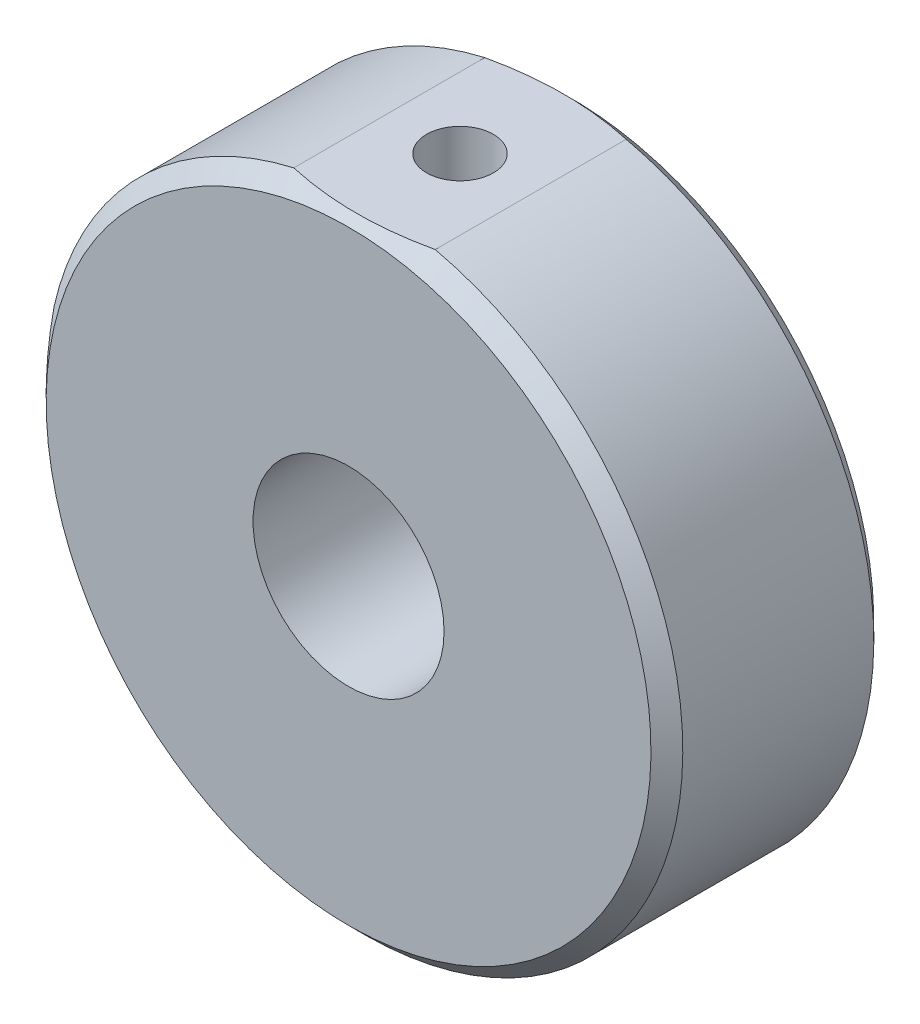
ISO-10303-21;
HEADER;
FILE_DESCRIPTION(('STEP AP214'),'2;1');
FILE_NAME('part.step','',(''),(''),'','','');
FILE_SCHEMA(('AUTOMOTIVE_DESIGN { 1 0 10303 214 1 1 1 1 }'));
ENDSEC;
DATA;
#1=APPLICATION_CONTEXT('core data for automotive mechanical design processes');
#2=APPLICATION_PROTOCOL_DEFINITION('international standard','automotive_design',2000,#1);
#3=PRODUCT_CONTEXT('',#1,'mechanical');
#4=PRODUCT('Part','Part','',(#3));
#5=PRODUCT_RELATED_PRODUCT_CATEGORY('part','',(#4));
#6=PRODUCT_DEFINITION_FORMATION('','',#4);
#7=PRODUCT_DEFINITION_CONTEXT('part definition',#1,'design');
#8=PRODUCT_DEFINITION('design','',#6,#7);
#9=PRODUCT_DEFINITION_SHAPE('','',#8);
#10=(LENGTH_UNIT() NAMED_UNIT(*) SI_UNIT(.MILLI.,.METRE.));
#11=(NAMED_UNIT(*) PLANE_ANGLE_UNIT() SI_UNIT($,.RADIAN.));
#12=(NAMED_UNIT(*) SI_UNIT($,.STERADIAN.) SOLID_ANGLE_UNIT());
#13=UNCERTAINTY_MEASURE_WITH_UNIT(LENGTH_MEASURE(1.E-05),#10,'distance_accuracy_value','');
#14=(GEOMETRIC_REPRESENTATION_CONTEXT(3) GLOBAL_UNCERTAINTY_ASSIGNED_CONTEXT((#13)) GLOBAL_UNIT_ASSIGNED_CONTEXT((#10,
#11,#12)) REPRESENTATION_CONTEXT('',''));
#15=CARTESIAN_POINT('',(0.,0.,0.));
#16=DIRECTION('',(0.,0.,1.));
#17=DIRECTION('',(1.,0.,0.));
#18=AXIS2_PLACEMENT_3D('',#15,#16,#17);
#19=CARTESIAN_POINT('',(0.,0.,14.));
#20=DIRECTION('',(0.,0.,1.));
#21=DIRECTION('',(1.,0.,0.));
#22=AXIS2_PLACEMENT_3D('',#19,#20,#21);
#23=PLANE('',#22);
#24=CARTESIAN_POINT('',(0.,0.,14.));
#25=DIRECTION('',(0.,0.,1.));
#26=DIRECTION('',(1.,0.,0.));
#27=AXIS2_PLACEMENT_3D('',#24,#25,#26);
#28=CIRCLE('',#27,19.);
#29=CARTESIAN_POINT('',(-4.2218923482249,18.525,14.));
#30=VERTEX_POINT('',#29);
#31=EDGE_CURVE('E52',#30,#30,#28,.T.);
#32=ORIENTED_EDGE('',*,*,#31,.T.);
#33=EDGE_LOOP('',(#32));
#34=FACE_BOUND('',#33,.T.);
#35=CARTESIAN_POINT('',(0.,0.,14.));
#36=DIRECTION('',(0.,0.,1.));
#37=DIRECTION('',(1.,0.,0.));
#38=AXIS2_PLACEMENT_3D('',#35,#36,#37);
#39=CIRCLE('',#38,6.);
#40=CARTESIAN_POINT('',(6.,0.,14.));
#41=VERTEX_POINT('',#40);
#42=EDGE_CURVE('E166',#41,#41,#39,.T.);
#43=ORIENTED_EDGE('',*,*,#42,.F.);
#44=EDGE_LOOP('',(#43));
#45=FACE_BOUND('',#44,.T.);
#46=ADVANCED_FACE('F35',(#34,#45),#23,.T.);
#47=CARTESIAN_POINT('',(0.,0.,0.));
#48=DIRECTION('',(0.,0.,1.));
#49=DIRECTION('',(1.,0.,0.));
#50=AXIS2_PLACEMENT_3D('',#47,#48,#49);
#51=PLANE('',#50);
#52=CARTESIAN_POINT('',(0.,0.,0.));
#53=DIRECTION('',(0.,0.,1.));
#54=DIRECTION('',(1.,0.,0.));
#55=AXIS2_PLACEMENT_3D('',#52,#53,#54);
#56=CIRCLE('',#55,19.);
#57=CARTESIAN_POINT('',(-4.2218923482249,18.525,0.));
#58=VERTEX_POINT('',#57);
#59=EDGE_CURVE('E11',#58,#58,#56,.F.);
#60=ORIENTED_EDGE('',*,*,#59,.T.);
#61=EDGE_LOOP('',(#60));
#62=FACE_BOUND('',#61,.T.);
#63=CARTESIAN_POINT('',(0.,0.,0.));
#64=DIRECTION('',(0.,0.,1.));
#65=DIRECTION('',(1.,0.,0.));
#66=AXIS2_PLACEMENT_3D('',#63,#64,#65);
#67=CIRCLE('',#66,6.);
#68=CARTESIAN_POINT('',(6.,0.,0.));
#69=VERTEX_POINT('',#68);
#70=EDGE_CURVE('E164',#69,#69,#67,.T.);
#71=ORIENTED_EDGE('',*,*,#70,.T.);
#72=EDGE_LOOP('',(#71));
#73=FACE_BOUND('',#72,.T.);
#74=ADVANCED_FACE('F126',(#62,#73),#51,.F.);
#75=CARTESIAN_POINT('',(0.,0.,14.));
#76=DIRECTION('',(0.,0.,-1.));
#77=DIRECTION('',(-1.,0.,0.));
#78=AXIS2_PLACEMENT_3D('',#75,#76,#77);
#79=CYLINDRICAL_SURFACE('',#78,20.);
#80=DIRECTION('',(0.,0.,-1.));
#81=VECTOR('',#80,1.);
#82=CARTESIAN_POINT('',(4.44409720865779,19.5,14.));
#83=LINE('',#82,#81);
#84=CARTESIAN_POINT('',(4.44409720865779,19.5,13.));
#85=VERTEX_POINT('',#84);
#86=CARTESIAN_POINT('',(4.44409720865779,19.5,0.999999999999999));
#87=VERTEX_POINT('',#86);
#88=EDGE_CURVE('E173',#85,#87,#83,.T.);
#89=ORIENTED_EDGE('',*,*,#88,.F.);
#90=CARTESIAN_POINT('',(0.,0.,13.));
#91=DIRECTION('',(0.,0.,-1.));
#92=DIRECTION('',(-1.,0.,0.));
#93=AXIS2_PLACEMENT_3D('',#90,#91,#92);
#94=CIRCLE('',#93,20.);
#95=CARTESIAN_POINT('',(-19.5,-4.44409720865783,13.));
#96=VERTEX_POINT('',#95);
#97=EDGE_CURVE('E187',#85,#96,#94,.T.);
#98=ORIENTED_EDGE('',*,*,#97,.T.);
#99=DIRECTION('',(0.,0.,-1.));
#100=VECTOR('',#99,1.);
#101=CARTESIAN_POINT('',(-19.5,-4.44409720865783,14.));
#102=LINE('',#101,#100);
#103=CARTESIAN_POINT('',(-19.5,-4.44409720865783,1.));
#104=VERTEX_POINT('',#103);
#105=EDGE_CURVE('E84',#96,#104,#102,.T.);
#106=ORIENTED_EDGE('',*,*,#105,.T.);
#107=CARTESIAN_POINT('',(0.,0.,1.));
#108=DIRECTION('',(0.,0.,1.));
#109=DIRECTION('',(1.,0.,0.));
#110=AXIS2_PLACEMENT_3D('',#107,#108,#109);
#111=CIRCLE('',#110,20.);
#112=EDGE_CURVE('E186',#104,#87,#111,.T.);
#113=ORIENTED_EDGE('',*,*,#112,.T.);
#114=EDGE_LOOP('',(#89,#98,#106,#113));
#115=FACE_BOUND('',#114,.T.);
#116=ADVANCED_FACE('F121',(#115),#79,.T.);
#117=CARTESIAN_POINT('',(-4.44409720865779,19.5,14.));
#118=DIRECTION('',(0.,-1.,0.));
#119=DIRECTION('',(0.,0.,-1.));
#120=AXIS2_PLACEMENT_3D('',#117,#118,#119);
#121=PLANE('',#120);
#122=CARTESIAN_POINT('',(0.,19.5,7.));
#123=DIRECTION('',(0.,1.,0.));
#124=DIRECTION('',(0.,0.,1.));
#125=AXIS2_PLACEMENT_3D('',#122,#123,#124);
#126=CIRCLE('',#125,2.09999999999999);
#127=CARTESIAN_POINT('',(0.,19.5,9.09999999999999));
#128=VERTEX_POINT('',#127);
#129=EDGE_CURVE('E165',#128,#128,#126,.T.);
#130=ORIENTED_EDGE('',*,*,#129,.F.);
#131=EDGE_LOOP('',(#130));
#132=FACE_BOUND('',#131,.T.);
#133=DIRECTION('',(0.,0.,-1.));
#134=VECTOR('',#133,1.);
#135=CARTESIAN_POINT('',(-4.44409720865779,19.5,14.));
#136=LINE('',#135,#134);
#137=CARTESIAN_POINT('',(-4.44409720865779,19.5,13.));
#138=VERTEX_POINT('',#137);
#139=CARTESIAN_POINT('',(-4.44409720865779,19.5,1.00000000000001));
#140=VERTEX_POINT('',#139);
#141=EDGE_CURVE('E98',#138,#140,#136,.T.);
#142=ORIENTED_EDGE('',*,*,#141,.F.);
#143=CARTESIAN_POINT('',(-4.44409720865779,19.5,13.));
#144=CARTESIAN_POINT('',(-4.19998041472766,19.5,13.0542534426218));
#145=CARTESIAN_POINT('',(-3.95494907397,19.5,13.1044426126926));
#146=CARTESIAN_POINT('',(-3.46327045746739,19.5,13.1963133008438));
#147=CARTESIAN_POINT('',(-3.21662300545133,19.5,13.2379938743854));
#148=CARTESIAN_POINT('',(-2.72187842229033,19.5,13.3124712843307));
#149=CARTESIAN_POINT('',(-2.47378073936363,19.5,13.3452644794387));
#150=CARTESIAN_POINT('',(-1.97656220348127,19.5,13.401639434868));
#151=CARTESIAN_POINT('',(-1.72744138944716,19.5,13.4252215423733));
#152=CARTESIAN_POINT('',(-0.989582138907035,19.5,13.4809696706977));
#153=CARTESIAN_POINT('',(-0.499752548169044,19.5,13.4997426988401));
#154=CARTESIAN_POINT('',(0.479706710049869,19.5,13.5002521481147));
#155=CARTESIAN_POINT('',(0.969336390650333,19.5,13.4820006406622));
#156=CARTESIAN_POINT('',(2.01715462635274,19.5,13.4038824216482));
#157=CARTESIAN_POINT('',(2.57492397302026,19.5,13.3383329128359));
#158=CARTESIAN_POINT('',(3.68373467146969,19.5,13.1626695390764));
#159=CARTESIAN_POINT('',(4.23477044033588,19.5,13.0525209787831));
#160=CARTESIAN_POINT('',(5.34099358027311,19.5,12.789104135404));
#161=CARTESIAN_POINT('',(5.89593474985478,19.5,12.6348177665614));
#162=CARTESIAN_POINT('',(6.99355346764258,19.5,12.2903857295308));
#163=CARTESIAN_POINT('',(7.53625100046284,19.5,12.1003040742772));
#164=CARTESIAN_POINT('',(8.07274418775188,19.5,11.895043266548));
#165=B_SPLINE_CURVE_WITH_KNOTS('',3,(#143,#144,#145,#146,#147,#148,#149,#150,#151,#152,#153,
#154,#155,#156,#157,#158,#159,#160,#161,#162,#163,#164),.UNSPECIFIED.,.F.,.F.,(4,2,2,2,2,2,2,2,
2,2,4),(0.,0.750199479304313,1.50048219296257,2.25107184585193,3.00163320481129,
4.47069012827003,5.93926815993727,7.62209777872449,9.30623905948282,11.0328842517489,
12.75647050224),.UNSPECIFIED.);
#166=EDGE_CURVE('E101',#138,#85,#165,.T.);
#167=ORIENTED_EDGE('',*,*,#166,.T.);
#168=ORIENTED_EDGE('',*,*,#88,.T.);
#169=CARTESIAN_POINT('',(4.44409720865779,19.5,0.999999999999998));
#170=CARTESIAN_POINT('',(4.19998041472766,19.5,0.945746557378239));
#171=CARTESIAN_POINT('',(3.95494907397,19.5,0.89555738730737));
#172=CARTESIAN_POINT('',(3.46327045746739,19.5,0.803686699156215));
#173=CARTESIAN_POINT('',(3.21662300545134,19.5,0.762006125614582));
#174=CARTESIAN_POINT('',(2.72187842229033,19.5,0.687528715669268));
#175=CARTESIAN_POINT('',(2.47378073936363,19.5,0.654735520561267));
#176=CARTESIAN_POINT('',(1.97656220348127,19.5,0.598360565132));
#177=CARTESIAN_POINT('',(1.72744138944716,19.5,0.574778457626738));
#178=CARTESIAN_POINT('',(0.989582138907035,19.5,0.519030329302326));
#179=CARTESIAN_POINT('',(0.499752548169045,19.5,0.500257301159913));
#180=CARTESIAN_POINT('',(-0.47970671004987,19.5,0.499747851885359));
#181=CARTESIAN_POINT('',(-0.969336390650334,19.5,0.517999359337806));
#182=CARTESIAN_POINT('',(-2.01715462635274,19.5,0.596117578351778));
#183=CARTESIAN_POINT('',(-2.57492397302026,19.5,0.661667087164062));
#184=CARTESIAN_POINT('',(-3.68373467146968,19.5,0.837330460923594));
#185=CARTESIAN_POINT('',(-4.23477044033587,19.5,0.947479021216934));
#186=CARTESIAN_POINT('',(-5.34099358027309,19.5,1.21089586459604));
#187=CARTESIAN_POINT('',(-5.89593474985476,19.5,1.36518223343856));
#188=CARTESIAN_POINT('',(-6.99355346764256,19.5,1.70961427046916));
#189=CARTESIAN_POINT('',(-7.53625100046281,19.5,1.89969592572283));
#190=CARTESIAN_POINT('',(-8.07274418775185,19.5,2.10495673345201));
#191=B_SPLINE_CURVE_WITH_KNOTS('',3,(#169,#170,#171,#172,#173,#174,#175,#176,#177,#178,#179,
#180,#181,#182,#183,#184,#185,#186,#187,#188,#189,#190),.UNSPECIFIED.,.F.,.F.,(4,2,2,2,2,2,2,2,
2,2,4),(0.,0.750199479304313,1.50048219296257,2.25107184585193,3.00163320481129,
4.47069012827003,5.93926815993728,7.62209777872448,9.30623905948281,11.0328842517489,
12.75647050224),.UNSPECIFIED.);
#192=EDGE_CURVE('E102',#87,#140,#191,.T.);
#193=ORIENTED_EDGE('',*,*,#192,.T.);
#194=EDGE_LOOP('',(#142,#167,#168,#193));
#195=FACE_BOUND('',#194,.T.);
#196=ADVANCED_FACE('F116',(#132,#195),#121,.F.);
#197=CARTESIAN_POINT('',(0.,0.,14.));
#198=DIRECTION('',(0.,0.,-1.));
#199=DIRECTION('',(-1.,0.,0.));
#200=AXIS2_PLACEMENT_3D('',#197,#198,#199);
#201=CYLINDRICAL_SURFACE('',#200,20.);
#202=DIRECTION('',(0.,0.,-1.));
#203=VECTOR('',#202,1.);
#204=CARTESIAN_POINT('',(-19.5,4.44409720865783,14.));
#205=LINE('',#204,#203);
#206=CARTESIAN_POINT('',(-19.5,4.44409720865783,13.));
#207=VERTEX_POINT('',#206);
#208=CARTESIAN_POINT('',(-19.5,4.44409720865783,1.00000000000001));
#209=VERTEX_POINT('',#208);
#210=EDGE_CURVE('E82',#207,#209,#205,.T.);
#211=ORIENTED_EDGE('',*,*,#210,.F.);
#212=CARTESIAN_POINT('',(0.,0.,13.));
#213=DIRECTION('',(0.,0.,1.));
#214=DIRECTION('',(1.,0.,0.));
#215=AXIS2_PLACEMENT_3D('',#212,#213,#214);
#216=CIRCLE('',#215,20.);
#217=EDGE_CURVE('E94',#207,#138,#216,.F.);
#218=ORIENTED_EDGE('',*,*,#217,.T.);
#219=ORIENTED_EDGE('',*,*,#141,.T.);
#220=CARTESIAN_POINT('',(0.,0.,1.));
#221=DIRECTION('',(0.,0.,1.));
#222=DIRECTION('',(1.,0.,0.));
#223=AXIS2_PLACEMENT_3D('',#220,#221,#222);
#224=CIRCLE('',#223,20.);
#225=EDGE_CURVE('E97',#140,#209,#224,.T.);
#226=ORIENTED_EDGE('',*,*,#225,.T.);
#227=EDGE_LOOP('',(#211,#218,#219,#226));
#228=FACE_BOUND('',#227,.T.);
#229=ADVANCED_FACE('F92',(#228),#201,.T.);
#230=CARTESIAN_POINT('',(-19.5,-4.44409720865783,14.));
#231=DIRECTION('',(1.,0.,0.));
#232=DIRECTION('',(0.,0.,-1.));
#233=AXIS2_PLACEMENT_3D('',#230,#231,#232);
#234=PLANE('',#233);
#235=ORIENTED_EDGE('',*,*,#105,.F.);
#236=CARTESIAN_POINT('',(-19.5,-4.44409720865783,13.));
#237=CARTESIAN_POINT('',(-19.5,-4.1999804147277,13.0542534426218));
#238=CARTESIAN_POINT('',(-19.5,-3.95494907397004,13.1044426126926));
#239=CARTESIAN_POINT('',(-19.5,-3.46327045746742,13.1963133008438));
#240=CARTESIAN_POINT('',(-19.5,-3.21662300545137,13.2379938743854));
#241=CARTESIAN_POINT('',(-19.5,-2.72187842229037,13.3124712843307));
#242=CARTESIAN_POINT('',(-19.5,-2.47378073936367,13.3452644794387));
#243=CARTESIAN_POINT('',(-19.5,-1.97656220348131,13.401639434868));
#244=CARTESIAN_POINT('',(-19.5,-1.7274413894472,13.4252215423733));
#245=CARTESIAN_POINT('',(-19.5,-0.989582138907072,13.4809696706977));
#246=CARTESIAN_POINT('',(-19.5,-0.499752548169082,13.4997426988401));
#247=CARTESIAN_POINT('',(-19.5,0.479706710049832,13.5002521481146));
#248=CARTESIAN_POINT('',(-19.5,0.969336390650297,13.4820006406622));
#249=CARTESIAN_POINT('',(-19.5,2.0171546263527,13.4038824216482));
#250=CARTESIAN_POINT('',(-19.5,2.57492397302023,13.3383329128359));
#251=CARTESIAN_POINT('',(-19.5,3.68373467146966,13.1626695390764));
#252=CARTESIAN_POINT('',(-19.5,4.23477044033585,13.0525209787831));
#253=CARTESIAN_POINT('',(-19.5,5.34099358027307,12.789104135404));
#254=CARTESIAN_POINT('',(-19.5,5.89593474985474,12.6348177665615));
#255=CARTESIAN_POINT('',(-19.5,6.99355346764254,12.2903857295309));
#256=CARTESIAN_POINT('',(-19.5,7.5362510004628,12.1003040742772));
#257=CARTESIAN_POINT('',(-19.5,8.07274418775184,11.895043266548));
#258=B_SPLINE_CURVE_WITH_KNOTS('',3,(#236,#237,#238,#239,#240,#241,#242,#243,#244,#245,#246,
#247,#248,#249,#250,#251,#252,#253,#254,#255,#256,#257),.UNSPECIFIED.,.F.,.F.,(4,2,2,2,2,2,2,2,
2,2,4),(0.,0.750199479304313,1.50048219296258,2.25107184585193,3.00163320481129,
4.47069012827003,5.93926815993728,7.62209777872449,9.30623905948282,11.0328842517489,
12.75647050224),.UNSPECIFIED.);
#259=EDGE_CURVE('E44',#96,#207,#258,.T.);
#260=ORIENTED_EDGE('',*,*,#259,.T.);
#261=ORIENTED_EDGE('',*,*,#210,.T.);
#262=CARTESIAN_POINT('',(-19.5,4.44409720865783,1.00000000000001));
#263=CARTESIAN_POINT('',(-19.5,4.1999804147277,0.945746557378249));
#264=CARTESIAN_POINT('',(-19.5,3.95494907397004,0.895557387307378));
#265=CARTESIAN_POINT('',(-19.5,3.46327045746742,0.803686699156221));
#266=CARTESIAN_POINT('',(-19.5,3.21662300545137,0.762006125614588));
#267=CARTESIAN_POINT('',(-19.5,2.72187842229037,0.687528715669276));
#268=CARTESIAN_POINT('',(-19.5,2.47378073936367,0.654735520561277));
#269=CARTESIAN_POINT('',(-19.5,1.97656220348131,0.59836056513201));
#270=CARTESIAN_POINT('',(-19.5,1.7274413894472,0.574778457626746));
#271=CARTESIAN_POINT('',(-19.5,0.989582138907069,0.51903032930233));
#272=CARTESIAN_POINT('',(-19.5,0.499752548169078,0.500257301159914));
#273=CARTESIAN_POINT('',(-19.5,-0.479706710049836,0.499747851885358));
#274=CARTESIAN_POINT('',(-19.5,-0.9693363906503,0.517999359337805));
#275=CARTESIAN_POINT('',(-19.5,-2.0171546263527,0.596117578351779));
#276=CARTESIAN_POINT('',(-19.5,-2.57492397302023,0.661667087164062));
#277=CARTESIAN_POINT('',(-19.5,-3.68373467146965,0.837330460923594));
#278=CARTESIAN_POINT('',(-19.5,-4.23477044033584,0.947479021216932));
#279=CARTESIAN_POINT('',(-19.5,-5.34099358027307,1.21089586459603));
#280=CARTESIAN_POINT('',(-19.5,-5.89593474985473,1.36518223343855));
#281=CARTESIAN_POINT('',(-19.5,-6.99355346764254,1.70961427046916));
#282=CARTESIAN_POINT('',(-19.5,-7.53625100046279,1.89969592572283));
#283=CARTESIAN_POINT('',(-19.5,-8.07274418775183,2.10495673345201));
#284=B_SPLINE_CURVE_WITH_KNOTS('',3,(#262,#263,#264,#265,#266,#267,#268,#269,#270,#271,#272,
#273,#274,#275,#276,#277,#278,#279,#280,#281,#282,#283),.UNSPECIFIED.,.F.,.F.,(4,2,2,2,2,2,2,2,
2,2,4),(0.,0.750199479304314,1.50048219296258,2.25107184585194,3.00163320481129,
4.47069012827003,5.93926815993728,7.62209777872449,9.30623905948282,11.0328842517489,
12.75647050224),.UNSPECIFIED.);
#285=EDGE_CURVE('E88',#209,#104,#284,.T.);
#286=ORIENTED_EDGE('',*,*,#285,.T.);
#287=EDGE_LOOP('',(#235,#260,#261,#286));
#288=FACE_BOUND('',#287,.T.);
#289=ADVANCED_FACE('F81',(#288),#234,.F.);
#290=CARTESIAN_POINT('',(0.,0.,14.));
#291=DIRECTION('',(0.,0.,-1.));
#292=DIRECTION('',(-1.,0.,0.));
#293=AXIS2_PLACEMENT_3D('',#290,#291,#292);
#294=CYLINDRICAL_SURFACE('',#293,6.);
#295=CARTESIAN_POINT('',(0.,6.,9.09999999999999));
#296=CARTESIAN_POINT('',(-0.114251619400622,6.00000124479722,9.10000177398963));
#297=CARTESIAN_POINT('',(-0.228490572963443,5.99670718672287,9.09064619715678));
#298=CARTESIAN_POINT('',(-0.453584015501343,5.98389272550116,9.05359972410268));
#299=CARTESIAN_POINT('',(-0.564438489369617,5.97437229456631,9.0259087460529));
#300=CARTESIAN_POINT('',(-0.779485413609652,5.95013476153419,8.95327063689881));
#301=CARTESIAN_POINT('',(-0.883689296254849,5.93542687718391,8.90835410213658));
#302=CARTESIAN_POINT('',(-1.0830819871769,5.9023013983887,8.80268493324158));
#303=CARTESIAN_POINT('',(-1.17826873947788,5.88388296088765,8.74192869932603));
#304=CARTESIAN_POINT('',(-1.36051553523195,5.8444837041619,8.60390289060956));
#305=CARTESIAN_POINT('',(-1.44718917885624,5.82343705066232,8.52614204906653));
#306=CARTESIAN_POINT('',(-1.60656711090756,5.78150036966384,8.35735799863156));
#307=CARTESIAN_POINT('',(-1.67926788523806,5.76061038283182,8.26633146358774));
#308=CARTESIAN_POINT('',(-1.8109377386165,5.72061212527967,8.07000721026479));
#309=CARTESIAN_POINT('',(-1.86938779836972,5.70158313672156,7.96434366492447));
#310=CARTESIAN_POINT('',(-1.96751959370707,5.66847146607346,7.74391324582527));
#311=CARTESIAN_POINT('',(-2.0072077327117,5.65438709681398,7.62914949359435));
#312=CARTESIAN_POINT('',(-2.06520983596549,5.63345661812697,7.398194180391));
#313=CARTESIAN_POINT('',(-2.08425340292729,5.62636429642411,7.28220886171828));
#314=CARTESIAN_POINT('',(-2.10270718664323,5.61949543126127,7.0484889286481));
#315=CARTESIAN_POINT('',(-2.10212422592437,5.61971634559107,6.93075493634555));
#316=CARTESIAN_POINT('',(-2.08190459940415,5.6272345610432,6.70327032467044));
#317=CARTESIAN_POINT('',(-2.0632422906149,5.63416998262608,6.59341901183151));
#318=CARTESIAN_POINT('',(-2.008991449874,5.65374002730544,6.37851855622538));
#319=CARTESIAN_POINT('',(-1.97340069468363,5.66637539897383,6.27347004620447));
#320=CARTESIAN_POINT('',(-1.88570622655402,5.69616366426815,6.06903257993277));
#321=CARTESIAN_POINT('',(-1.83332799267826,5.71339079553398,5.96977266919094));
#322=CARTESIAN_POINT('',(-1.71373613101811,5.75039287731401,5.78115283060908));
#323=CARTESIAN_POINT('',(-1.64651787673616,5.77016862157703,5.69179600321364));
#324=CARTESIAN_POINT('',(-1.49456039711175,5.81143944787469,5.52007406297834));
#325=CARTESIAN_POINT('',(-1.40903164705239,5.83296775946525,5.43841405027078));
#326=CARTESIAN_POINT('',(-1.22523410835335,5.87432244482545,5.29040207686655));
#327=CARTESIAN_POINT('',(-1.12696383630198,5.8941486199791,5.22405190109764));
#328=CARTESIAN_POINT('',(-0.918860837471083,5.93017388019725,5.10789640524754));
#329=CARTESIAN_POINT('',(-0.808904282046237,5.94632692796734,5.05829766253292));
#330=CARTESIAN_POINT('',(-0.581505085784566,5.9728492941218,4.97852661588011));
#331=CARTESIAN_POINT('',(-0.464065343302138,5.98322083678151,4.94834684033705));
#332=CARTESIAN_POINT('',(-0.230989226208848,5.99663436097715,4.90956051194694));
#333=CARTESIAN_POINT('',(-0.1155295791762,5.99999933499256,4.90000251608865));
#334=CARTESIAN_POINT('',(0.115377891863059,6.00000066417894,4.89999748639476));
#335=CARTESIAN_POINT('',(0.23082571398975,5.99663828885113,4.90954684685785));
#336=CARTESIAN_POINT('',(0.454507376828142,5.98377619392239,4.9467432099422));
#337=CARTESIAN_POINT('',(0.562853716439328,5.97447978494587,4.97379108264015));
#338=CARTESIAN_POINT('',(0.773415026506116,5.95088754065552,5.04445228894033));
#339=CARTESIAN_POINT('',(0.875629201619191,5.93659105846679,5.08806776600755));
#340=CARTESIAN_POINT('',(1.0741840767636,5.90394255172608,5.19195405317889));
#341=CARTESIAN_POINT('',(1.17028394476469,5.88548924058916,5.25265239082213));
#342=CARTESIAN_POINT('',(1.35123467255018,5.84660110480211,5.38848710774389));
#343=CARTESIAN_POINT('',(1.43608178143558,5.82616562334246,5.46362828093436));
#344=CARTESIAN_POINT('',(1.59657189228235,5.78430503834525,5.63068012096844));
#345=CARTESIAN_POINT('',(1.67153670697073,5.76288189348748,5.7232444647861));
#346=CARTESIAN_POINT('',(1.80497245575436,5.72249507214417,5.92008753963991));
#347=CARTESIAN_POINT('',(1.86344281114401,5.70353148196433,6.02436668150853));
#348=CARTESIAN_POINT('',(1.96206588887548,5.67036332969683,6.2420003741245));
#349=CARTESIAN_POINT('',(2.00221823839335,5.65615886447257,6.35535510953101));
#350=CARTESIAN_POINT('',(2.0626509971247,5.63440525238851,6.58783927233181));
#351=CARTESIAN_POINT('',(2.08294160282034,5.62685269082108,6.70696570369192));
#352=CARTESIAN_POINT('',(2.10223163577423,5.61967236621944,6.94037219292531));
#353=CARTESIAN_POINT('',(2.10236838468444,5.61962128080686,7.05454617801122));
#354=CARTESIAN_POINT('',(2.08419060013712,5.62638796100477,7.28119757389456));
#355=CARTESIAN_POINT('',(2.06587739236711,5.63320523310212,7.39367510599812));
#356=CARTESIAN_POINT('',(2.01215791883085,5.65261016405341,7.6111305752457));
#357=CARTESIAN_POINT('',(1.97715663433252,5.66506076725229,7.71622178000828));
#358=CARTESIAN_POINT('',(1.89139271747184,5.69426693797299,7.91911485688415));
#359=CARTESIAN_POINT('',(1.84062637606361,5.71102351840213,8.01691500690893));
#360=CARTESIAN_POINT('',(1.72198212419163,5.74793925414686,8.20746074523538));
#361=CARTESIAN_POINT('',(1.65340944434222,5.76822170996008,8.29974964012088));
#362=CARTESIAN_POINT('',(1.50223440680438,5.80942536879987,8.47187657721011));
#363=CARTESIAN_POINT('',(1.41962789186428,5.83034675958784,8.55171091651121));
#364=CARTESIAN_POINT('',(1.23831189902208,5.87159201716309,8.70027026902842));
#365=CARTESIAN_POINT('',(1.13904838717693,5.89184757341827,8.76834067030566));
#366=CARTESIAN_POINT('',(0.929800577449991,5.92846815702942,8.88677409716774));
#367=CARTESIAN_POINT('',(0.819817701917963,5.94483369956207,8.93713946795423));
#368=CARTESIAN_POINT('',(0.593417902635956,5.97165768609899,9.0179543314247));
#369=CARTESIAN_POINT('',(0.477083727751899,5.98217829048397,9.04861396514205));
#370=CARTESIAN_POINT('',(0.240494094963199,5.99634758229624,9.08963229100308));
#371=CARTESIAN_POINT('',(0.120240033294065,5.99999868995766,9.099998133028));
#372=CARTESIAN_POINT('',(0.,6.,9.09999999999999));
#373=B_SPLINE_CURVE_WITH_KNOTS('',3,(#295,#296,#297,#298,#299,#300,#301,#302,#303,#304,#305,
#306,#307,#308,#309,#310,#311,#312,#313,#314,#315,#316,#317,#318,#319,#320,#321,#322,#323,#324,
#325,#326,#327,#328,#329,#330,#331,#332,#333,#334,#335,#336,#337,#338,#339,#340,#341,#342,#343,
#344,#345,#346,#347,#348,#349,#350,#351,#352,#353,#354,#355,#356,#357,#358,#359,#360,#361,#362,
#363,#364,#365,#366,#367,#368,#369,#370,#371,#372),.UNSPECIFIED.,.T.,.F.,(4,2,2,2,2,2,2,2,2,2,2,
2,2,2,2,2,2,2,2,2,2,2,2,2,2,2,2,2,2,2,2,2,2,2,2,2,2,2,4),(0.,0.34231196641885,0.684625460541924,
1.0263337265292,1.36811971807276,1.72152774061768,2.07502452728511,2.4399323068826,
2.80471545382671,3.15613820349783,3.50743879368811,3.84080280321038,4.1742106060309,
4.51337542799156,4.85264613704542,5.21157468826311,5.57054506475925,5.93379308543941,
6.29690125979618,6.64286253258118,6.98875852603915,7.32339682261908,7.65807842841232,
8.00202226625163,8.34608046478826,8.70745545379959,9.06884312002094,9.43023814118969,
9.79144753447258,10.1322648947516,10.4730577679758,10.8059714961507,11.1389636083741,
11.4876784253318,11.8364967229958,12.2008786824211,12.5652123577469,12.925593343809,
13.2858473380638),.UNSPECIFIED.);
#374=CARTESIAN_POINT('',(0.,6.,9.09999999999999));
#375=VERTEX_POINT('',#374);
#376=EDGE_CURVE('E158',#375,#375,#373,.T.);
#377=ORIENTED_EDGE('',*,*,#376,.F.);
#378=EDGE_LOOP('',(#377));
#379=FACE_BOUND('',#378,.T.);
#380=ORIENTED_EDGE('',*,*,#42,.T.);
#381=EDGE_LOOP('',(#380));
#382=FACE_BOUND('',#381,.T.);
#383=ORIENTED_EDGE('',*,*,#70,.F.);
#384=EDGE_LOOP('',(#383));
#385=FACE_BOUND('',#384,.T.);
#386=ADVANCED_FACE('F143',(#379,#382,#385),#294,.F.);
#387=CARTESIAN_POINT('',(0.,19.5,7.));
#388=DIRECTION('',(0.,1.,0.));
#389=DIRECTION('',(0.,0.,1.));
#390=AXIS2_PLACEMENT_3D('',#387,#388,#389);
#391=CYLINDRICAL_SURFACE('',#390,2.09999999999999);
#392=ORIENTED_EDGE('',*,*,#129,.T.);
#393=EDGE_LOOP('',(#392));
#394=FACE_BOUND('',#393,.T.);
#395=ORIENTED_EDGE('',*,*,#376,.T.);
#396=EDGE_LOOP('',(#395));
#397=FACE_BOUND('',#396,.T.);
#398=ADVANCED_FACE('F130',(#394,#397),#391,.F.);
#399=CARTESIAN_POINT('',(0.,0.,14.));
#400=DIRECTION('',(0.,0.,-1.));
#401=DIRECTION('',(-1.,0.,0.));
#402=AXIS2_PLACEMENT_3D('',#399,#400,#401);
#403=CONICAL_SURFACE('',#402,19.,0.785398163397448);
#404=ORIENTED_EDGE('',*,*,#166,.F.);
#405=ORIENTED_EDGE('',*,*,#217,.F.);
#406=ORIENTED_EDGE('',*,*,#259,.F.);
#407=ORIENTED_EDGE('',*,*,#97,.F.);
#408=EDGE_LOOP('',(#404,#405,#406,#407));
#409=FACE_BOUND('',#408,.T.);
#410=ORIENTED_EDGE('',*,*,#31,.F.);
#411=EDGE_LOOP('',(#410));
#412=FACE_BOUND('',#411,.T.);
#413=ADVANCED_FACE('F100',(#409,#412),#403,.T.);
#414=CARTESIAN_POINT('',(0.,0.,1.));
#415=DIRECTION('',(0.,0.,1.));
#416=DIRECTION('',(1.,0.,0.));
#417=AXIS2_PLACEMENT_3D('',#414,#415,#416);
#418=CONICAL_SURFACE('',#417,20.,0.785398163397447);
#419=ORIENTED_EDGE('',*,*,#59,.F.);
#420=EDGE_LOOP('',(#419));
#421=FACE_BOUND('',#420,.T.);
#422=ORIENTED_EDGE('',*,*,#285,.F.);
#423=ORIENTED_EDGE('',*,*,#225,.F.);
#424=ORIENTED_EDGE('',*,*,#192,.F.);
#425=ORIENTED_EDGE('',*,*,#112,.F.);
#426=EDGE_LOOP('',(#422,#423,#424,#425));
#427=FACE_BOUND('',#426,.T.);
#428=ADVANCED_FACE('F37',(#421,#427),#418,.T.);
#429=CLOSED_SHELL('',(#46,#74,#116,#196,#229,#289,#386,#398,#413,#428));
#430=MANIFOLD_SOLID_BREP('B2',#429);
#431=ADVANCED_BREP_SHAPE_REPRESENTATION('',(#18,#430),#14);
#432=SHAPE_DEFINITION_REPRESENTATION(#9,#431);
ENDSEC;
END-ISO-10303-21;
